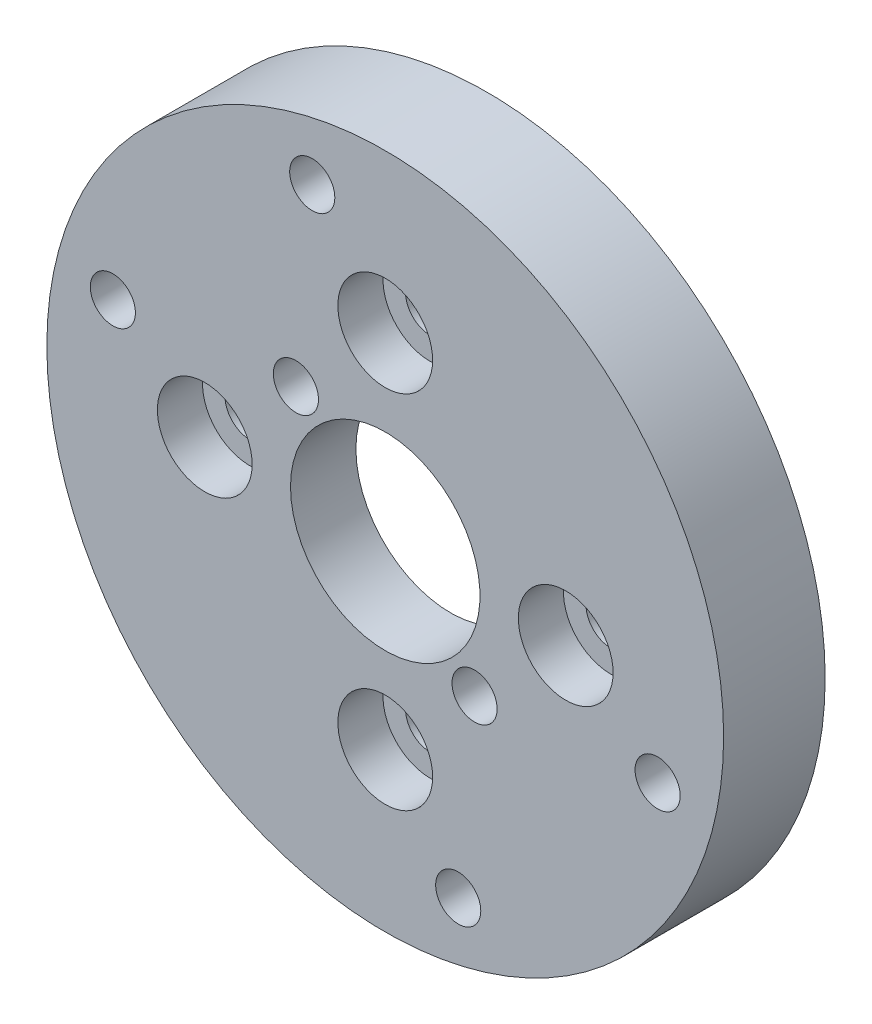
ISO-10303-21;
HEADER;
FILE_DESCRIPTION(('STEP AP214'),'2;1');
FILE_NAME('part.step','',(''),(''),'','','');
FILE_SCHEMA(('AUTOMOTIVE_DESIGN { 1 0 10303 214 1 1 1 1 }'));
ENDSEC;
DATA;
#1=APPLICATION_CONTEXT('core data for automotive mechanical design processes');
#2=APPLICATION_PROTOCOL_DEFINITION('international standard','automotive_design',2000,#1);
#3=PRODUCT_CONTEXT('',#1,'mechanical');
#4=PRODUCT('Part','Part','',(#3));
#5=PRODUCT_RELATED_PRODUCT_CATEGORY('part','',(#4));
#6=PRODUCT_DEFINITION_FORMATION('','',#4);
#7=PRODUCT_DEFINITION_CONTEXT('part definition',#1,'design');
#8=PRODUCT_DEFINITION('design','',#6,#7);
#9=PRODUCT_DEFINITION_SHAPE('','',#8);
#10=(LENGTH_UNIT() NAMED_UNIT(*) SI_UNIT(.MILLI.,.METRE.));
#11=(NAMED_UNIT(*) PLANE_ANGLE_UNIT() SI_UNIT($,.RADIAN.));
#12=(NAMED_UNIT(*) SI_UNIT($,.STERADIAN.) SOLID_ANGLE_UNIT());
#13=UNCERTAINTY_MEASURE_WITH_UNIT(LENGTH_MEASURE(1.E-05),#10,'distance_accuracy_value','');
#14=(GEOMETRIC_REPRESENTATION_CONTEXT(3) GLOBAL_UNCERTAINTY_ASSIGNED_CONTEXT((#13)) GLOBAL_UNIT_ASSIGNED_CONTEXT((#10,
#11,#12)) REPRESENTATION_CONTEXT('',''));
#15=CARTESIAN_POINT('',(0.,0.,0.));
#16=DIRECTION('',(0.,0.,1.));
#17=DIRECTION('',(1.,0.,0.));
#18=AXIS2_PLACEMENT_3D('',#15,#16,#17);
#19=CARTESIAN_POINT('',(8.00000000000027,2.75810479722345E-13,4.5));
#20=DIRECTION('',(0.,0.,-1.));
#21=DIRECTION('',(-1.,0.,0.));
#22=AXIS2_PLACEMENT_3D('',#19,#20,#21);
#23=CYLINDRICAL_SURFACE('',#22,1.10000000000009);
#24=CARTESIAN_POINT('',(8.00000000000027,2.75810479722345E-13,2.5));
#25=DIRECTION('',(0.,0.,1.));
#26=DIRECTION('',(1.,0.,0.));
#27=AXIS2_PLACEMENT_3D('',#24,#25,#26);
#28=CIRCLE('',#27,1.10000000000009);
#29=CARTESIAN_POINT('',(9.10000000000036,2.75810479722345E-13,2.5));
#30=VERTEX_POINT('',#29);
#31=EDGE_CURVE('E35',#30,#30,#28,.T.);
#32=ORIENTED_EDGE('',*,*,#31,.T.);
#33=EDGE_LOOP('',(#32));
#34=FACE_BOUND('',#33,.T.);
#35=CARTESIAN_POINT('',(8.00000000000027,2.75810479722345E-13,1.6));
#36=DIRECTION('',(0.,0.,-1.));
#37=DIRECTION('',(-1.,0.,0.));
#38=AXIS2_PLACEMENT_3D('',#35,#36,#37);
#39=CIRCLE('',#38,1.10000000000009);
#40=CARTESIAN_POINT('',(6.90000000000019,2.75810479722345E-13,1.6));
#41=VERTEX_POINT('',#40);
#42=EDGE_CURVE('E229',#41,#41,#39,.T.);
#43=ORIENTED_EDGE('',*,*,#42,.T.);
#44=EDGE_LOOP('',(#43));
#45=FACE_BOUND('',#44,.T.);
#46=ADVANCED_FACE('F31',(#34,#45),#23,.F.);
#47=CARTESIAN_POINT('',(5.5162095944469E-13,-8.,4.5));
#48=DIRECTION('',(0.,0.,-1.));
#49=DIRECTION('',(-1.,0.,0.));
#50=AXIS2_PLACEMENT_3D('',#47,#48,#49);
#51=CYLINDRICAL_SURFACE('',#50,1.10000000000014);
#52=CARTESIAN_POINT('',(5.5162095944469E-13,-8.,2.5));
#53=DIRECTION('',(0.,0.,1.));
#54=DIRECTION('',(1.,0.,0.));
#55=AXIS2_PLACEMENT_3D('',#52,#53,#54);
#56=CIRCLE('',#55,1.10000000000014);
#57=CARTESIAN_POINT('',(1.10000000000069,-8.,2.5));
#58=VERTEX_POINT('',#57);
#59=EDGE_CURVE('E57',#58,#58,#56,.T.);
#60=ORIENTED_EDGE('',*,*,#59,.T.);
#61=EDGE_LOOP('',(#60));
#62=FACE_BOUND('',#61,.T.);
#63=CARTESIAN_POINT('',(5.5162095944469E-13,-8.,1.6));
#64=DIRECTION('',(0.,0.,-1.));
#65=DIRECTION('',(-1.,0.,0.));
#66=AXIS2_PLACEMENT_3D('',#63,#64,#65);
#67=CIRCLE('',#66,1.10000000000014);
#68=CARTESIAN_POINT('',(-1.09999999999958,-8.,1.6));
#69=VERTEX_POINT('',#68);
#70=EDGE_CURVE('E226',#69,#69,#67,.T.);
#71=ORIENTED_EDGE('',*,*,#70,.T.);
#72=EDGE_LOOP('',(#71));
#73=FACE_BOUND('',#72,.T.);
#74=ADVANCED_FACE('F114',(#62,#73),#51,.F.);
#75=CARTESIAN_POINT('',(-7.99999999999972,-2.76790197161663E-13,4.5));
#76=DIRECTION('',(0.,0.,-1.));
#77=DIRECTION('',(-1.,0.,0.));
#78=AXIS2_PLACEMENT_3D('',#75,#76,#77);
#79=CYLINDRICAL_SURFACE('',#78,1.10000000000022);
#80=CARTESIAN_POINT('',(-7.99999999999972,-2.76790197161663E-13,2.5));
#81=DIRECTION('',(0.,0.,1.));
#82=DIRECTION('',(1.,0.,0.));
#83=AXIS2_PLACEMENT_3D('',#80,#81,#82);
#84=CIRCLE('',#83,1.10000000000022);
#85=CARTESIAN_POINT('',(-6.89999999999951,-2.76790197161663E-13,2.5));
#86=VERTEX_POINT('',#85);
#87=EDGE_CURVE('E55',#86,#86,#84,.T.);
#88=ORIENTED_EDGE('',*,*,#87,.T.);
#89=EDGE_LOOP('',(#88));
#90=FACE_BOUND('',#89,.T.);
#91=CARTESIAN_POINT('',(-7.99999999999972,-2.76790197161663E-13,1.6));
#92=DIRECTION('',(0.,0.,-1.));
#93=DIRECTION('',(-1.,0.,0.));
#94=AXIS2_PLACEMENT_3D('',#91,#92,#93);
#95=CIRCLE('',#94,1.10000000000022);
#96=CARTESIAN_POINT('',(-9.09999999999994,-2.76790197161663E-13,1.6));
#97=VERTEX_POINT('',#96);
#98=EDGE_CURVE('E223',#97,#97,#95,.T.);
#99=ORIENTED_EDGE('',*,*,#98,.T.);
#100=EDGE_LOOP('',(#99));
#101=FACE_BOUND('',#100,.T.);
#102=ADVANCED_FACE('F118',(#90,#101),#79,.F.);
#103=CARTESIAN_POINT('',(0.,8.,4.5));
#104=DIRECTION('',(0.,0.,-1.));
#105=DIRECTION('',(-1.,0.,0.));
#106=AXIS2_PLACEMENT_3D('',#103,#104,#105);
#107=CYLINDRICAL_SURFACE('',#106,1.1);
#108=CARTESIAN_POINT('',(0.,8.,2.5));
#109=DIRECTION('',(0.,0.,1.));
#110=DIRECTION('',(1.,0.,0.));
#111=AXIS2_PLACEMENT_3D('',#108,#109,#110);
#112=CIRCLE('',#111,1.1);
#113=CARTESIAN_POINT('',(1.1,8.,2.5));
#114=VERTEX_POINT('',#113);
#115=EDGE_CURVE('E50',#114,#114,#112,.T.);
#116=ORIENTED_EDGE('',*,*,#115,.T.);
#117=EDGE_LOOP('',(#116));
#118=FACE_BOUND('',#117,.T.);
#119=CARTESIAN_POINT('',(0.,8.,1.6));
#120=DIRECTION('',(0.,0.,-1.));
#121=DIRECTION('',(-1.,0.,0.));
#122=AXIS2_PLACEMENT_3D('',#119,#120,#121);
#123=CIRCLE('',#122,1.1);
#124=CARTESIAN_POINT('',(-1.1,8.,1.6));
#125=VERTEX_POINT('',#124);
#126=EDGE_CURVE('E218',#125,#125,#123,.T.);
#127=ORIENTED_EDGE('',*,*,#126,.T.);
#128=EDGE_LOOP('',(#127));
#129=FACE_BOUND('',#128,.T.);
#130=ADVANCED_FACE('F123',(#118,#129),#107,.F.);
#131=CARTESIAN_POINT('',(0.,0.,4.5));
#132=DIRECTION('',(0.,0.,1.));
#133=DIRECTION('',(1.,0.,0.));
#134=AXIS2_PLACEMENT_3D('',#131,#132,#133);
#135=PLANE('',#134);
#136=CARTESIAN_POINT('',(3.95979797464466,-3.95979797464467,4.5));
#137=DIRECTION('',(0.,0.,1.));
#138=DIRECTION('',(1.,0.,0.));
#139=AXIS2_PLACEMENT_3D('',#136,#137,#138);
#140=CIRCLE('',#139,0.999999999999998);
#141=CARTESIAN_POINT('',(4.95979797464466,-3.95979797464467,4.5));
#142=VERTEX_POINT('',#141);
#143=EDGE_CURVE('E198',#142,#142,#140,.T.);
#144=ORIENTED_EDGE('',*,*,#143,.F.);
#145=EDGE_LOOP('',(#144));
#146=FACE_BOUND('',#145,.T.);
#147=CARTESIAN_POINT('',(-3.95979797464466,3.95979797464467,4.5));
#148=DIRECTION('',(0.,0.,1.));
#149=DIRECTION('',(1.,0.,0.));
#150=AXIS2_PLACEMENT_3D('',#147,#148,#149);
#151=CIRCLE('',#150,1.);
#152=CARTESIAN_POINT('',(-2.95979797464466,3.95979797464467,4.5));
#153=VERTEX_POINT('',#152);
#154=EDGE_CURVE('E197',#153,#153,#151,.T.);
#155=ORIENTED_EDGE('',*,*,#154,.F.);
#156=EDGE_LOOP('',(#155));
#157=FACE_BOUND('',#156,.T.);
#158=CARTESIAN_POINT('',(0.,0.,4.5));
#159=DIRECTION('',(0.,0.,-1.));
#160=DIRECTION('',(-1.,0.,0.));
#161=AXIS2_PLACEMENT_3D('',#158,#159,#160);
#162=CIRCLE('',#161,4.2);
#163=CARTESIAN_POINT('',(-4.2,0.,4.5));
#164=VERTEX_POINT('',#163);
#165=EDGE_CURVE('E209',#164,#164,#162,.T.);
#166=ORIENTED_EDGE('',*,*,#165,.T.);
#167=EDGE_LOOP('',(#166));
#168=FACE_BOUND('',#167,.T.);
#169=CARTESIAN_POINT('',(8.00000000000023,2.26393958003914E-13,4.5));
#170=DIRECTION('',(0.,0.,1.));
#171=DIRECTION('',(1.,0.,0.));
#172=AXIS2_PLACEMENT_3D('',#169,#170,#171);
#173=CIRCLE('',#172,2.10000000000018);
#174=CARTESIAN_POINT('',(10.1000000000004,2.26393958003914E-13,4.5));
#175=VERTEX_POINT('',#174);
#176=EDGE_CURVE('E235',#175,#175,#173,.T.);
#177=ORIENTED_EDGE('',*,*,#176,.F.);
#178=EDGE_LOOP('',(#177));
#179=FACE_BOUND('',#178,.T.);
#180=CARTESIAN_POINT('',(4.52787916007828E-13,-8.,4.5));
#181=DIRECTION('',(0.,0.,1.));
#182=DIRECTION('',(1.,0.,0.));
#183=AXIS2_PLACEMENT_3D('',#180,#181,#182);
#184=CIRCLE('',#183,2.10000000000049);
#185=CARTESIAN_POINT('',(2.10000000000094,-8.,4.5));
#186=VERTEX_POINT('',#185);
#187=EDGE_CURVE('E241',#186,#186,#184,.T.);
#188=ORIENTED_EDGE('',*,*,#187,.F.);
#189=EDGE_LOOP('',(#188));
#190=FACE_BOUND('',#189,.T.);
#191=CARTESIAN_POINT('',(-7.99999999999977,-2.27373675443232E-13,4.5));
#192=DIRECTION('',(0.,0.,1.));
#193=DIRECTION('',(1.,0.,0.));
#194=AXIS2_PLACEMENT_3D('',#191,#192,#193);
#195=CIRCLE('',#194,2.10000000000036);
#196=CARTESIAN_POINT('',(-5.89999999999941,-2.27373675443232E-13,4.5));
#197=VERTEX_POINT('',#196);
#198=EDGE_CURVE('E232',#197,#197,#195,.T.);
#199=ORIENTED_EDGE('',*,*,#198,.F.);
#200=EDGE_LOOP('',(#199));
#201=FACE_BOUND('',#200,.T.);
#202=CARTESIAN_POINT('',(0.,8.,4.5));
#203=DIRECTION('',(0.,0.,1.));
#204=DIRECTION('',(1.,0.,0.));
#205=AXIS2_PLACEMENT_3D('',#202,#203,#204);
#206=CIRCLE('',#205,2.1);
#207=CARTESIAN_POINT('',(2.1,8.,4.5));
#208=VERTEX_POINT('',#207);
#209=EDGE_CURVE('E63',#208,#208,#206,.T.);
#210=ORIENTED_EDGE('',*,*,#209,.F.);
#211=EDGE_LOOP('',(#210));
#212=FACE_BOUND('',#211,.T.);
#213=CARTESIAN_POINT('',(3.23523806378152,-12.0740728286134,4.5));
#214=DIRECTION('',(0.,0.,1.));
#215=DIRECTION('',(1.,0.,0.));
#216=AXIS2_PLACEMENT_3D('',#213,#214,#215);
#217=CIRCLE('',#216,0.999999999999999);
#218=CARTESIAN_POINT('',(4.23523806378152,-12.0740728286134,4.5));
#219=VERTEX_POINT('',#218);
#220=EDGE_CURVE('E80',#219,#219,#217,.T.);
#221=ORIENTED_EDGE('',*,*,#220,.F.);
#222=EDGE_LOOP('',(#221));
#223=FACE_BOUND('',#222,.T.);
#224=CARTESIAN_POINT('',(0.,0.,4.5));
#225=DIRECTION('',(0.,0.,1.));
#226=DIRECTION('',(1.,0.,0.));
#227=AXIS2_PLACEMENT_3D('',#224,#225,#226);
#228=CIRCLE('',#227,15.);
#229=CARTESIAN_POINT('',(15.,0.,4.5));
#230=VERTEX_POINT('',#229);
#231=EDGE_CURVE('E10',#230,#230,#228,.T.);
#232=ORIENTED_EDGE('',*,*,#231,.T.);
#233=EDGE_LOOP('',(#232));
#234=FACE_BOUND('',#233,.T.);
#235=CARTESIAN_POINT('',(-3.23523806378152,12.0740728286134,4.5));
#236=DIRECTION('',(0.,0.,1.));
#237=DIRECTION('',(1.,0.,0.));
#238=AXIS2_PLACEMENT_3D('',#235,#236,#237);
#239=CIRCLE('',#238,1.);
#240=CARTESIAN_POINT('',(-2.23523806378152,12.0740728286134,4.5));
#241=VERTEX_POINT('',#240);
#242=EDGE_CURVE('E44',#241,#241,#239,.T.);
#243=ORIENTED_EDGE('',*,*,#242,.F.);
#244=EDGE_LOOP('',(#243));
#245=FACE_BOUND('',#244,.T.);
#246=CARTESIAN_POINT('',(12.0740728286133,-3.23523806378156,4.5));
#247=DIRECTION('',(0.,0.,1.));
#248=DIRECTION('',(-1.,0.,0.));
#249=AXIS2_PLACEMENT_3D('',#246,#247,#248);
#250=CIRCLE('',#249,0.999999999999999);
#251=CARTESIAN_POINT('',(11.0740728286133,-3.23523806378156,4.5));
#252=VERTEX_POINT('',#251);
#253=EDGE_CURVE('E86',#252,#252,#250,.T.);
#254=ORIENTED_EDGE('',*,*,#253,.F.);
#255=EDGE_LOOP('',(#254));
#256=FACE_BOUND('',#255,.T.);
#257=CARTESIAN_POINT('',(-12.0740728286133,3.23523806378155,4.5));
#258=DIRECTION('',(0.,0.,1.));
#259=DIRECTION('',(-1.,0.,0.));
#260=AXIS2_PLACEMENT_3D('',#257,#258,#259);
#261=CIRCLE('',#260,0.999999999999998);
#262=CARTESIAN_POINT('',(-13.0740728286133,3.23523806378155,4.5));
#263=VERTEX_POINT('',#262);
#264=EDGE_CURVE('E74',#263,#263,#261,.T.);
#265=ORIENTED_EDGE('',*,*,#264,.F.);
#266=EDGE_LOOP('',(#265));
#267=FACE_BOUND('',#266,.T.);
#268=ADVANCED_FACE('F250',(#146,#157,#168,#179,#190,#201,#212,#223,#234,#245,#256,#267),#135,.T.);
#269=CARTESIAN_POINT('',(0.,0.,0.));
#270=DIRECTION('',(0.,0.,1.));
#271=DIRECTION('',(1.,0.,0.));
#272=AXIS2_PLACEMENT_3D('',#269,#270,#271);
#273=PLANE('',#272);
#274=CARTESIAN_POINT('',(0.,0.,0.));
#275=DIRECTION('',(0.,0.,-1.));
#276=DIRECTION('',(-1.,0.,0.));
#277=AXIS2_PLACEMENT_3D('',#274,#275,#276);
#278=CIRCLE('',#277,10.);
#279=CARTESIAN_POINT('',(-10.,0.,0.));
#280=VERTEX_POINT('',#279);
#281=EDGE_CURVE('E212',#280,#280,#278,.T.);
#282=ORIENTED_EDGE('',*,*,#281,.F.);
#283=EDGE_LOOP('',(#282));
#284=FACE_BOUND('',#283,.T.);
#285=CARTESIAN_POINT('',(0.,0.,0.));
#286=DIRECTION('',(0.,0.,1.));
#287=DIRECTION('',(1.,0.,0.));
#288=AXIS2_PLACEMENT_3D('',#285,#286,#287);
#289=CIRCLE('',#288,15.);
#290=CARTESIAN_POINT('',(15.,0.,0.));
#291=VERTEX_POINT('',#290);
#292=EDGE_CURVE('E39',#291,#291,#289,.T.);
#293=ORIENTED_EDGE('',*,*,#292,.F.);
#294=EDGE_LOOP('',(#293));
#295=FACE_BOUND('',#294,.T.);
#296=CARTESIAN_POINT('',(-3.23523806378152,12.0740728286134,0.));
#297=DIRECTION('',(0.,0.,1.));
#298=DIRECTION('',(1.,0.,0.));
#299=AXIS2_PLACEMENT_3D('',#296,#297,#298);
#300=CIRCLE('',#299,1.);
#301=CARTESIAN_POINT('',(-2.23523806378152,12.0740728286134,0.));
#302=VERTEX_POINT('',#301);
#303=EDGE_CURVE('E47',#302,#302,#300,.T.);
#304=ORIENTED_EDGE('',*,*,#303,.T.);
#305=EDGE_LOOP('',(#304));
#306=FACE_BOUND('',#305,.T.);
#307=CARTESIAN_POINT('',(12.0740728286133,-3.23523806378156,0.));
#308=DIRECTION('',(0.,0.,1.));
#309=DIRECTION('',(-1.,0.,0.));
#310=AXIS2_PLACEMENT_3D('',#307,#308,#309);
#311=CIRCLE('',#310,0.999999999999999);
#312=CARTESIAN_POINT('',(11.0740728286133,-3.23523806378156,0.));
#313=VERTEX_POINT('',#312);
#314=EDGE_CURVE('E83',#313,#313,#311,.T.);
#315=ORIENTED_EDGE('',*,*,#314,.T.);
#316=EDGE_LOOP('',(#315));
#317=FACE_BOUND('',#316,.T.);
#318=CARTESIAN_POINT('',(3.23523806378152,-12.0740728286134,0.));
#319=DIRECTION('',(0.,0.,1.));
#320=DIRECTION('',(1.,0.,0.));
#321=AXIS2_PLACEMENT_3D('',#318,#319,#320);
#322=CIRCLE('',#321,0.999999999999999);
#323=CARTESIAN_POINT('',(4.23523806378152,-12.0740728286134,0.));
#324=VERTEX_POINT('',#323);
#325=EDGE_CURVE('E77',#324,#324,#322,.T.);
#326=ORIENTED_EDGE('',*,*,#325,.T.);
#327=EDGE_LOOP('',(#326));
#328=FACE_BOUND('',#327,.T.);
#329=CARTESIAN_POINT('',(-12.0740728286133,3.23523806378155,0.));
#330=DIRECTION('',(0.,0.,1.));
#331=DIRECTION('',(-1.,0.,0.));
#332=AXIS2_PLACEMENT_3D('',#329,#330,#331);
#333=CIRCLE('',#332,0.999999999999998);
#334=CARTESIAN_POINT('',(-13.0740728286133,3.23523806378155,0.));
#335=VERTEX_POINT('',#334);
#336=EDGE_CURVE('E53',#335,#335,#333,.T.);
#337=ORIENTED_EDGE('',*,*,#336,.T.);
#338=EDGE_LOOP('',(#337));
#339=FACE_BOUND('',#338,.T.);
#340=ADVANCED_FACE('F96',(#284,#295,#306,#317,#328,#339),#273,.F.);
#341=CARTESIAN_POINT('',(0.,0.,4.5));
#342=DIRECTION('',(0.,0.,-1.));
#343=DIRECTION('',(-1.,0.,0.));
#344=AXIS2_PLACEMENT_3D('',#341,#342,#343);
#345=CYLINDRICAL_SURFACE('',#344,15.);
#346=ORIENTED_EDGE('',*,*,#231,.F.);
#347=EDGE_LOOP('',(#346));
#348=FACE_BOUND('',#347,.T.);
#349=ORIENTED_EDGE('',*,*,#292,.T.);
#350=EDGE_LOOP('',(#349));
#351=FACE_BOUND('',#350,.T.);
#352=ADVANCED_FACE('F33',(#348,#351),#345,.T.);
#353=CARTESIAN_POINT('',(-3.23523806378152,12.0740728286134,4.5));
#354=DIRECTION('',(0.,0.,-1.));
#355=DIRECTION('',(-1.,0.,0.));
#356=AXIS2_PLACEMENT_3D('',#353,#354,#355);
#357=CYLINDRICAL_SURFACE('',#356,1.);
#358=ORIENTED_EDGE('',*,*,#242,.T.);
#359=EDGE_LOOP('',(#358));
#360=FACE_BOUND('',#359,.T.);
#361=ORIENTED_EDGE('',*,*,#303,.F.);
#362=EDGE_LOOP('',(#361));
#363=FACE_BOUND('',#362,.T.);
#364=ADVANCED_FACE('F99',(#360,#363),#357,.F.);
#365=CARTESIAN_POINT('',(12.0740728286133,-3.23523806378156,4.5));
#366=DIRECTION('',(0.,0.,-1.));
#367=DIRECTION('',(-1.,0.,0.));
#368=AXIS2_PLACEMENT_3D('',#365,#366,#367);
#369=CYLINDRICAL_SURFACE('',#368,0.999999999999999);
#370=ORIENTED_EDGE('',*,*,#253,.T.);
#371=EDGE_LOOP('',(#370));
#372=FACE_BOUND('',#371,.T.);
#373=ORIENTED_EDGE('',*,*,#314,.F.);
#374=EDGE_LOOP('',(#373));
#375=FACE_BOUND('',#374,.T.);
#376=ADVANCED_FACE('F101',(#372,#375),#369,.F.);
#377=CARTESIAN_POINT('',(3.23523806378152,-12.0740728286134,4.5));
#378=DIRECTION('',(0.,0.,-1.));
#379=DIRECTION('',(-1.,0.,0.));
#380=AXIS2_PLACEMENT_3D('',#377,#378,#379);
#381=CYLINDRICAL_SURFACE('',#380,0.999999999999999);
#382=ORIENTED_EDGE('',*,*,#220,.T.);
#383=EDGE_LOOP('',(#382));
#384=FACE_BOUND('',#383,.T.);
#385=ORIENTED_EDGE('',*,*,#325,.F.);
#386=EDGE_LOOP('',(#385));
#387=FACE_BOUND('',#386,.T.);
#388=ADVANCED_FACE('F107',(#384,#387),#381,.F.);
#389=CARTESIAN_POINT('',(-12.0740728286133,3.23523806378155,4.5));
#390=DIRECTION('',(0.,0.,-1.));
#391=DIRECTION('',(-1.,0.,0.));
#392=AXIS2_PLACEMENT_3D('',#389,#390,#391);
#393=CYLINDRICAL_SURFACE('',#392,0.999999999999998);
#394=ORIENTED_EDGE('',*,*,#264,.T.);
#395=EDGE_LOOP('',(#394));
#396=FACE_BOUND('',#395,.T.);
#397=ORIENTED_EDGE('',*,*,#336,.F.);
#398=EDGE_LOOP('',(#397));
#399=FACE_BOUND('',#398,.T.);
#400=ADVANCED_FACE('F128',(#396,#399),#393,.F.);
#401=CARTESIAN_POINT('',(0.,8.,2.5));
#402=DIRECTION('',(0.,0.,1.));
#403=DIRECTION('',(1.,0.,0.));
#404=AXIS2_PLACEMENT_3D('',#401,#402,#403);
#405=CYLINDRICAL_SURFACE('',#404,2.1);
#406=CARTESIAN_POINT('',(0.,8.,2.5));
#407=DIRECTION('',(0.,0.,1.));
#408=DIRECTION('',(1.,0.,0.));
#409=AXIS2_PLACEMENT_3D('',#406,#407,#408);
#410=CIRCLE('',#409,2.1);
#411=CARTESIAN_POINT('',(2.1,8.,2.5));
#412=VERTEX_POINT('',#411);
#413=EDGE_CURVE('E54',#412,#412,#410,.T.);
#414=ORIENTED_EDGE('',*,*,#413,.F.);
#415=EDGE_LOOP('',(#414));
#416=FACE_BOUND('',#415,.T.);
#417=ORIENTED_EDGE('',*,*,#209,.T.);
#418=EDGE_LOOP('',(#417));
#419=FACE_BOUND('',#418,.T.);
#420=ADVANCED_FACE('F132',(#416,#419),#405,.F.);
#421=CARTESIAN_POINT('',(0.,8.,2.5));
#422=DIRECTION('',(0.,0.,1.));
#423=DIRECTION('',(1.,0.,0.));
#424=AXIS2_PLACEMENT_3D('',#421,#422,#423);
#425=PLANE('',#424);
#426=ORIENTED_EDGE('',*,*,#115,.F.);
#427=EDGE_LOOP('',(#426));
#428=FACE_BOUND('',#427,.T.);
#429=ORIENTED_EDGE('',*,*,#413,.T.);
#430=EDGE_LOOP('',(#429));
#431=FACE_BOUND('',#430,.T.);
#432=ADVANCED_FACE('F136',(#428,#431),#425,.T.);
#433=CARTESIAN_POINT('',(-7.99999999999977,-2.27373675443232E-13,2.5));
#434=DIRECTION('',(0.,0.,1.));
#435=DIRECTION('',(1.,0.,0.));
#436=AXIS2_PLACEMENT_3D('',#433,#434,#435);
#437=CYLINDRICAL_SURFACE('',#436,2.10000000000036);
#438=CARTESIAN_POINT('',(-7.99999999999977,-2.27373675443232E-13,2.5));
#439=DIRECTION('',(0.,0.,1.));
#440=DIRECTION('',(1.,0.,0.));
#441=AXIS2_PLACEMENT_3D('',#438,#439,#440);
#442=CIRCLE('',#441,2.10000000000036);
#443=CARTESIAN_POINT('',(-5.89999999999941,-2.27373675443232E-13,2.5));
#444=VERTEX_POINT('',#443);
#445=EDGE_CURVE('E244',#444,#444,#442,.T.);
#446=ORIENTED_EDGE('',*,*,#445,.F.);
#447=EDGE_LOOP('',(#446));
#448=FACE_BOUND('',#447,.T.);
#449=ORIENTED_EDGE('',*,*,#198,.T.);
#450=EDGE_LOOP('',(#449));
#451=FACE_BOUND('',#450,.T.);
#452=ADVANCED_FACE('F140',(#448,#451),#437,.F.);
#453=CARTESIAN_POINT('',(-7.99999999999977,-2.27373675443232E-13,2.5));
#454=DIRECTION('',(0.,0.,1.));
#455=DIRECTION('',(1.,0.,0.));
#456=AXIS2_PLACEMENT_3D('',#453,#454,#455);
#457=PLANE('',#456);
#458=ORIENTED_EDGE('',*,*,#87,.F.);
#459=EDGE_LOOP('',(#458));
#460=FACE_BOUND('',#459,.T.);
#461=ORIENTED_EDGE('',*,*,#445,.T.);
#462=EDGE_LOOP('',(#461));
#463=FACE_BOUND('',#462,.T.);
#464=ADVANCED_FACE('F144',(#460,#463),#457,.T.);
#465=CARTESIAN_POINT('',(4.52787916007828E-13,-8.,2.5));
#466=DIRECTION('',(0.,0.,1.));
#467=DIRECTION('',(1.,0.,0.));
#468=AXIS2_PLACEMENT_3D('',#465,#466,#467);
#469=CYLINDRICAL_SURFACE('',#468,2.10000000000049);
#470=CARTESIAN_POINT('',(4.52787916007828E-13,-8.,2.5));
#471=DIRECTION('',(0.,0.,1.));
#472=DIRECTION('',(1.,0.,0.));
#473=AXIS2_PLACEMENT_3D('',#470,#471,#472);
#474=CIRCLE('',#473,2.10000000000049);
#475=CARTESIAN_POINT('',(2.10000000000094,-8.,2.5));
#476=VERTEX_POINT('',#475);
#477=EDGE_CURVE('E238',#476,#476,#474,.T.);
#478=ORIENTED_EDGE('',*,*,#477,.F.);
#479=EDGE_LOOP('',(#478));
#480=FACE_BOUND('',#479,.T.);
#481=ORIENTED_EDGE('',*,*,#187,.T.);
#482=EDGE_LOOP('',(#481));
#483=FACE_BOUND('',#482,.T.);
#484=ADVANCED_FACE('F148',(#480,#483),#469,.F.);
#485=CARTESIAN_POINT('',(4.52787916007828E-13,-8.,2.5));
#486=DIRECTION('',(0.,0.,1.));
#487=DIRECTION('',(1.,0.,0.));
#488=AXIS2_PLACEMENT_3D('',#485,#486,#487);
#489=PLANE('',#488);
#490=ORIENTED_EDGE('',*,*,#59,.F.);
#491=EDGE_LOOP('',(#490));
#492=FACE_BOUND('',#491,.T.);
#493=ORIENTED_EDGE('',*,*,#477,.T.);
#494=EDGE_LOOP('',(#493));
#495=FACE_BOUND('',#494,.T.);
#496=ADVANCED_FACE('F152',(#492,#495),#489,.T.);
#497=CARTESIAN_POINT('',(8.00000000000023,2.26393958003914E-13,2.5));
#498=DIRECTION('',(0.,0.,1.));
#499=DIRECTION('',(1.,0.,0.));
#500=AXIS2_PLACEMENT_3D('',#497,#498,#499);
#501=CYLINDRICAL_SURFACE('',#500,2.10000000000018);
#502=CARTESIAN_POINT('',(8.00000000000023,2.26393958003914E-13,2.5));
#503=DIRECTION('',(0.,0.,1.));
#504=DIRECTION('',(1.,0.,0.));
#505=AXIS2_PLACEMENT_3D('',#502,#503,#504);
#506=CIRCLE('',#505,2.10000000000018);
#507=CARTESIAN_POINT('',(10.1000000000004,2.26393958003914E-13,2.5));
#508=VERTEX_POINT('',#507);
#509=EDGE_CURVE('E58',#508,#508,#506,.T.);
#510=ORIENTED_EDGE('',*,*,#509,.F.);
#511=EDGE_LOOP('',(#510));
#512=FACE_BOUND('',#511,.T.);
#513=ORIENTED_EDGE('',*,*,#176,.T.);
#514=EDGE_LOOP('',(#513));
#515=FACE_BOUND('',#514,.T.);
#516=ADVANCED_FACE('F156',(#512,#515),#501,.F.);
#517=CARTESIAN_POINT('',(8.00000000000023,2.26393958003914E-13,2.5));
#518=DIRECTION('',(0.,0.,1.));
#519=DIRECTION('',(1.,0.,0.));
#520=AXIS2_PLACEMENT_3D('',#517,#518,#519);
#521=PLANE('',#520);
#522=ORIENTED_EDGE('',*,*,#31,.F.);
#523=EDGE_LOOP('',(#522));
#524=FACE_BOUND('',#523,.T.);
#525=ORIENTED_EDGE('',*,*,#509,.T.);
#526=EDGE_LOOP('',(#525));
#527=FACE_BOUND('',#526,.T.);
#528=ADVANCED_FACE('F160',(#524,#527),#521,.T.);
#529=CARTESIAN_POINT('',(0.,0.,1.6));
#530=DIRECTION('',(0.,0.,-1.));
#531=DIRECTION('',(-1.,0.,0.));
#532=AXIS2_PLACEMENT_3D('',#529,#530,#531);
#533=CYLINDRICAL_SURFACE('',#532,10.);
#534=CARTESIAN_POINT('',(0.,0.,1.6));
#535=DIRECTION('',(0.,0.,-1.));
#536=DIRECTION('',(-1.,0.,0.));
#537=AXIS2_PLACEMENT_3D('',#534,#535,#536);
#538=CIRCLE('',#537,10.);
#539=CARTESIAN_POINT('',(-10.,0.,1.6));
#540=VERTEX_POINT('',#539);
#541=EDGE_CURVE('E215',#540,#540,#538,.T.);
#542=ORIENTED_EDGE('',*,*,#541,.F.);
#543=EDGE_LOOP('',(#542));
#544=FACE_BOUND('',#543,.T.);
#545=ORIENTED_EDGE('',*,*,#281,.T.);
#546=EDGE_LOOP('',(#545));
#547=FACE_BOUND('',#546,.T.);
#548=ADVANCED_FACE('F164',(#544,#547),#533,.F.);
#549=CARTESIAN_POINT('',(0.,0.,1.6));
#550=DIRECTION('',(0.,0.,-1.));
#551=DIRECTION('',(-1.,0.,0.));
#552=AXIS2_PLACEMENT_3D('',#549,#550,#551);
#553=PLANE('',#552);
#554=CARTESIAN_POINT('',(0.,0.,1.6));
#555=DIRECTION('',(0.,0.,-1.));
#556=DIRECTION('',(-1.,0.,0.));
#557=AXIS2_PLACEMENT_3D('',#554,#555,#556);
#558=CIRCLE('',#557,4.2);
#559=CARTESIAN_POINT('',(-4.2,0.,1.6));
#560=VERTEX_POINT('',#559);
#561=EDGE_CURVE('E207',#560,#560,#558,.T.);
#562=ORIENTED_EDGE('',*,*,#561,.F.);
#563=EDGE_LOOP('',(#562));
#564=FACE_BOUND('',#563,.T.);
#565=ORIENTED_EDGE('',*,*,#42,.F.);
#566=EDGE_LOOP('',(#565));
#567=FACE_BOUND('',#566,.T.);
#568=ORIENTED_EDGE('',*,*,#70,.F.);
#569=EDGE_LOOP('',(#568));
#570=FACE_BOUND('',#569,.T.);
#571=ORIENTED_EDGE('',*,*,#98,.F.);
#572=EDGE_LOOP('',(#571));
#573=FACE_BOUND('',#572,.T.);
#574=ORIENTED_EDGE('',*,*,#126,.F.);
#575=EDGE_LOOP('',(#574));
#576=FACE_BOUND('',#575,.T.);
#577=ORIENTED_EDGE('',*,*,#541,.T.);
#578=EDGE_LOOP('',(#577));
#579=FACE_BOUND('',#578,.T.);
#580=ADVANCED_FACE('F168',(#564,#567,#570,#573,#576,#579),#553,.T.);
#581=CARTESIAN_POINT('',(0.,0.,4.5));
#582=DIRECTION('',(0.,0.,-1.));
#583=DIRECTION('',(-1.,0.,0.));
#584=AXIS2_PLACEMENT_3D('',#581,#582,#583);
#585=CYLINDRICAL_SURFACE('',#584,4.2);
#586=ORIENTED_EDGE('',*,*,#165,.F.);
#587=EDGE_LOOP('',(#586));
#588=FACE_BOUND('',#587,.T.);
#589=ORIENTED_EDGE('',*,*,#561,.T.);
#590=EDGE_LOOP('',(#589));
#591=FACE_BOUND('',#590,.T.);
#592=ADVANCED_FACE('F172',(#588,#591),#585,.F.);
#593=CARTESIAN_POINT('',(-3.95979797464466,3.95979797464467,2.5));
#594=DIRECTION('',(0.,0.,1.));
#595=DIRECTION('',(1.,0.,0.));
#596=AXIS2_PLACEMENT_3D('',#593,#594,#595);
#597=CYLINDRICAL_SURFACE('',#596,1.);
#598=CARTESIAN_POINT('',(-3.95979797464466,3.95979797464467,2.5));
#599=DIRECTION('',(0.,0.,1.));
#600=DIRECTION('',(1.,0.,0.));
#601=AXIS2_PLACEMENT_3D('',#598,#599,#600);
#602=CIRCLE('',#601,1.);
#603=CARTESIAN_POINT('',(-2.95979797464466,3.95979797464467,2.5));
#604=VERTEX_POINT('',#603);
#605=EDGE_CURVE('E201',#604,#604,#602,.T.);
#606=ORIENTED_EDGE('',*,*,#605,.F.);
#607=EDGE_LOOP('',(#606));
#608=FACE_BOUND('',#607,.T.);
#609=ORIENTED_EDGE('',*,*,#154,.T.);
#610=EDGE_LOOP('',(#609));
#611=FACE_BOUND('',#610,.T.);
#612=ADVANCED_FACE('F176',(#608,#611),#597,.F.);
#613=CARTESIAN_POINT('',(-3.95979797464466,3.95979797464467,2.5));
#614=DIRECTION('',(0.,0.,1.));
#615=DIRECTION('',(1.,0.,0.));
#616=AXIS2_PLACEMENT_3D('',#613,#614,#615);
#617=PLANE('',#616);
#618=ORIENTED_EDGE('',*,*,#605,.T.);
#619=EDGE_LOOP('',(#618));
#620=FACE_BOUND('',#619,.T.);
#621=ADVANCED_FACE('F180',(#620),#617,.T.);
#622=CARTESIAN_POINT('',(3.95979797464466,-3.95979797464467,2.5));
#623=DIRECTION('',(0.,0.,1.));
#624=DIRECTION('',(1.,0.,0.));
#625=AXIS2_PLACEMENT_3D('',#622,#623,#624);
#626=CYLINDRICAL_SURFACE('',#625,0.999999999999998);
#627=CARTESIAN_POINT('',(3.95979797464466,-3.95979797464467,2.5));
#628=DIRECTION('',(0.,0.,1.));
#629=DIRECTION('',(1.,0.,0.));
#630=AXIS2_PLACEMENT_3D('',#627,#628,#629);
#631=CIRCLE('',#630,0.999999999999998);
#632=CARTESIAN_POINT('',(4.95979797464466,-3.95979797464467,2.5));
#633=VERTEX_POINT('',#632);
#634=EDGE_CURVE('E196',#633,#633,#631,.T.);
#635=ORIENTED_EDGE('',*,*,#634,.F.);
#636=EDGE_LOOP('',(#635));
#637=FACE_BOUND('',#636,.T.);
#638=ORIENTED_EDGE('',*,*,#143,.T.);
#639=EDGE_LOOP('',(#638));
#640=FACE_BOUND('',#639,.T.);
#641=ADVANCED_FACE('F184',(#637,#640),#626,.F.);
#642=CARTESIAN_POINT('',(3.95979797464466,-3.95979797464467,2.5));
#643=DIRECTION('',(0.,0.,1.));
#644=DIRECTION('',(1.,0.,0.));
#645=AXIS2_PLACEMENT_3D('',#642,#643,#644);
#646=PLANE('',#645);
#647=ORIENTED_EDGE('',*,*,#634,.T.);
#648=EDGE_LOOP('',(#647));
#649=FACE_BOUND('',#648,.T.);
#650=ADVANCED_FACE('F188',(#649),#646,.T.);
#651=CLOSED_SHELL('',(#46,#74,#102,#130,#268,#340,#352,#364,#376,#388,#400,#420,#432,#452,#464,
#484,#496,#516,#528,#548,#580,#592,#612,#621,#641,#650));
#652=MANIFOLD_SOLID_BREP('B2',#651);
#653=ADVANCED_BREP_SHAPE_REPRESENTATION('',(#18,#652),#14);
#654=SHAPE_DEFINITION_REPRESENTATION(#9,#653);
ENDSEC;
END-ISO-10303-21;
